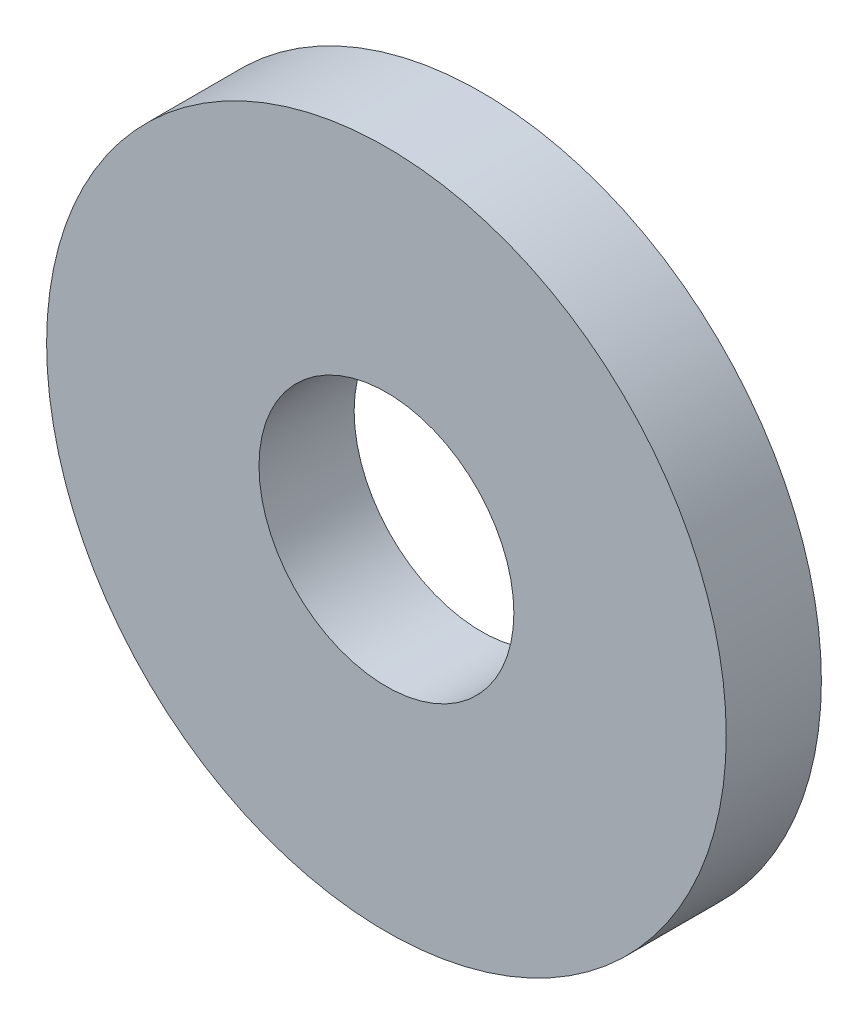
ISO-10303-21;
HEADER;
FILE_DESCRIPTION(('STEP AP214'),'2;1');
FILE_NAME('part.step','',(''),(''),'','','');
FILE_SCHEMA(('AUTOMOTIVE_DESIGN { 1 0 10303 214 1 1 1 1 }'));
ENDSEC;
DATA;
#1=APPLICATION_CONTEXT('core data for automotive mechanical design processes');
#2=APPLICATION_PROTOCOL_DEFINITION('international standard','automotive_design',2000,#1);
#3=PRODUCT_CONTEXT('',#1,'mechanical');
#4=PRODUCT('Part','Part','',(#3));
#5=PRODUCT_RELATED_PRODUCT_CATEGORY('part','',(#4));
#6=PRODUCT_DEFINITION_FORMATION('','',#4);
#7=PRODUCT_DEFINITION_CONTEXT('part definition',#1,'design');
#8=PRODUCT_DEFINITION('design','',#6,#7);
#9=PRODUCT_DEFINITION_SHAPE('','',#8);
#10=(LENGTH_UNIT() NAMED_UNIT(*) SI_UNIT(.MILLI.,.METRE.));
#11=(NAMED_UNIT(*) PLANE_ANGLE_UNIT() SI_UNIT($,.RADIAN.));
#12=(NAMED_UNIT(*) SI_UNIT($,.STERADIAN.) SOLID_ANGLE_UNIT());
#13=UNCERTAINTY_MEASURE_WITH_UNIT(LENGTH_MEASURE(1.E-05),#10,'distance_accuracy_value','');
#14=(GEOMETRIC_REPRESENTATION_CONTEXT(3) GLOBAL_UNCERTAINTY_ASSIGNED_CONTEXT((#13)) GLOBAL_UNIT_ASSIGNED_CONTEXT((#10,
#11,#12)) REPRESENTATION_CONTEXT('',''));
#15=CARTESIAN_POINT('',(0.,0.,0.));
#16=DIRECTION('',(0.,0.,1.));
#17=DIRECTION('',(1.,0.,0.));
#18=AXIS2_PLACEMENT_3D('',#15,#16,#17);
#19=CARTESIAN_POINT('',(0.,0.,3.556));
#20=DIRECTION('',(0.,0.,1.));
#21=DIRECTION('',(1.,0.,0.));
#22=AXIS2_PLACEMENT_3D('',#19,#20,#21);
#23=PLANE('',#22);
#24=CARTESIAN_POINT('',(0.,0.,3.556));
#25=DIRECTION('',(0.,0.,1.));
#26=DIRECTION('',(1.,0.,0.));
#27=AXIS2_PLACEMENT_3D('',#24,#25,#26);
#28=CIRCLE('',#27,4.7625);
#29=CARTESIAN_POINT('',(4.7625,0.,3.556));
#30=VERTEX_POINT('',#29);
#31=EDGE_CURVE('E27',#30,#30,#28,.F.);
#32=ORIENTED_EDGE('',*,*,#31,.T.);
#33=EDGE_LOOP('',(#32));
#34=FACE_BOUND('',#33,.T.);
#35=CARTESIAN_POINT('',(0.,0.,3.556));
#36=DIRECTION('',(0.,0.,1.));
#37=DIRECTION('',(1.,0.,0.));
#38=AXIS2_PLACEMENT_3D('',#35,#36,#37);
#39=CIRCLE('',#38,12.7);
#40=CARTESIAN_POINT('',(12.7,0.,3.556));
#41=VERTEX_POINT('',#40);
#42=EDGE_CURVE('E18',#41,#41,#39,.F.);
#43=ORIENTED_EDGE('',*,*,#42,.F.);
#44=EDGE_LOOP('',(#43));
#45=FACE_BOUND('',#44,.T.);
#46=ADVANCED_FACE('F15',(#34,#45),#23,.T.);
#47=CARTESIAN_POINT('',(0.,0.,0.));
#48=DIRECTION('',(0.,0.,1.));
#49=DIRECTION('',(1.,0.,0.));
#50=AXIS2_PLACEMENT_3D('',#47,#48,#49);
#51=CYLINDRICAL_SURFACE('',#50,12.7);
#52=CARTESIAN_POINT('',(0.,0.,0.));
#53=DIRECTION('',(0.,0.,1.));
#54=DIRECTION('',(1.,0.,0.));
#55=AXIS2_PLACEMENT_3D('',#52,#53,#54);
#56=CIRCLE('',#55,12.7);
#57=CARTESIAN_POINT('',(12.7,0.,0.));
#58=VERTEX_POINT('',#57);
#59=EDGE_CURVE('E22',#58,#58,#56,.T.);
#60=ORIENTED_EDGE('',*,*,#59,.T.);
#61=EDGE_LOOP('',(#60));
#62=FACE_BOUND('',#61,.T.);
#63=ORIENTED_EDGE('',*,*,#42,.T.);
#64=EDGE_LOOP('',(#63));
#65=FACE_BOUND('',#64,.T.);
#66=ADVANCED_FACE('F35',(#62,#65),#51,.T.);
#67=CARTESIAN_POINT('',(0.,0.,0.));
#68=DIRECTION('',(0.,0.,1.));
#69=DIRECTION('',(1.,0.,0.));
#70=AXIS2_PLACEMENT_3D('',#67,#68,#69);
#71=CYLINDRICAL_SURFACE('',#70,4.7625);
#72=ORIENTED_EDGE('',*,*,#31,.F.);
#73=EDGE_LOOP('',(#72));
#74=FACE_BOUND('',#73,.T.);
#75=CARTESIAN_POINT('',(0.,0.,0.));
#76=DIRECTION('',(0.,0.,1.));
#77=DIRECTION('',(1.,0.,0.));
#78=AXIS2_PLACEMENT_3D('',#75,#76,#77);
#79=CIRCLE('',#78,4.7625);
#80=CARTESIAN_POINT('',(4.7625,0.,0.));
#81=VERTEX_POINT('',#80);
#82=EDGE_CURVE('E10',#81,#81,#79,.F.);
#83=ORIENTED_EDGE('',*,*,#82,.T.);
#84=EDGE_LOOP('',(#83));
#85=FACE_BOUND('',#84,.T.);
#86=ADVANCED_FACE('F42',(#74,#85),#71,.F.);
#87=CARTESIAN_POINT('',(0.,0.,0.));
#88=DIRECTION('',(0.,0.,1.));
#89=DIRECTION('',(1.,0.,0.));
#90=AXIS2_PLACEMENT_3D('',#87,#88,#89);
#91=PLANE('',#90);
#92=ORIENTED_EDGE('',*,*,#82,.F.);
#93=EDGE_LOOP('',(#92));
#94=FACE_BOUND('',#93,.T.);
#95=ORIENTED_EDGE('',*,*,#59,.F.);
#96=EDGE_LOOP('',(#95));
#97=FACE_BOUND('',#96,.T.);
#98=ADVANCED_FACE('F44',(#94,#97),#91,.F.);
#99=CLOSED_SHELL('',(#46,#66,#86,#98));
#100=MANIFOLD_SOLID_BREP('B1',#99);
#101=ADVANCED_BREP_SHAPE_REPRESENTATION('',(#18,#100),#14);
#102=SHAPE_DEFINITION_REPRESENTATION(#9,#101);
ENDSEC;
END-ISO-10303-21;
